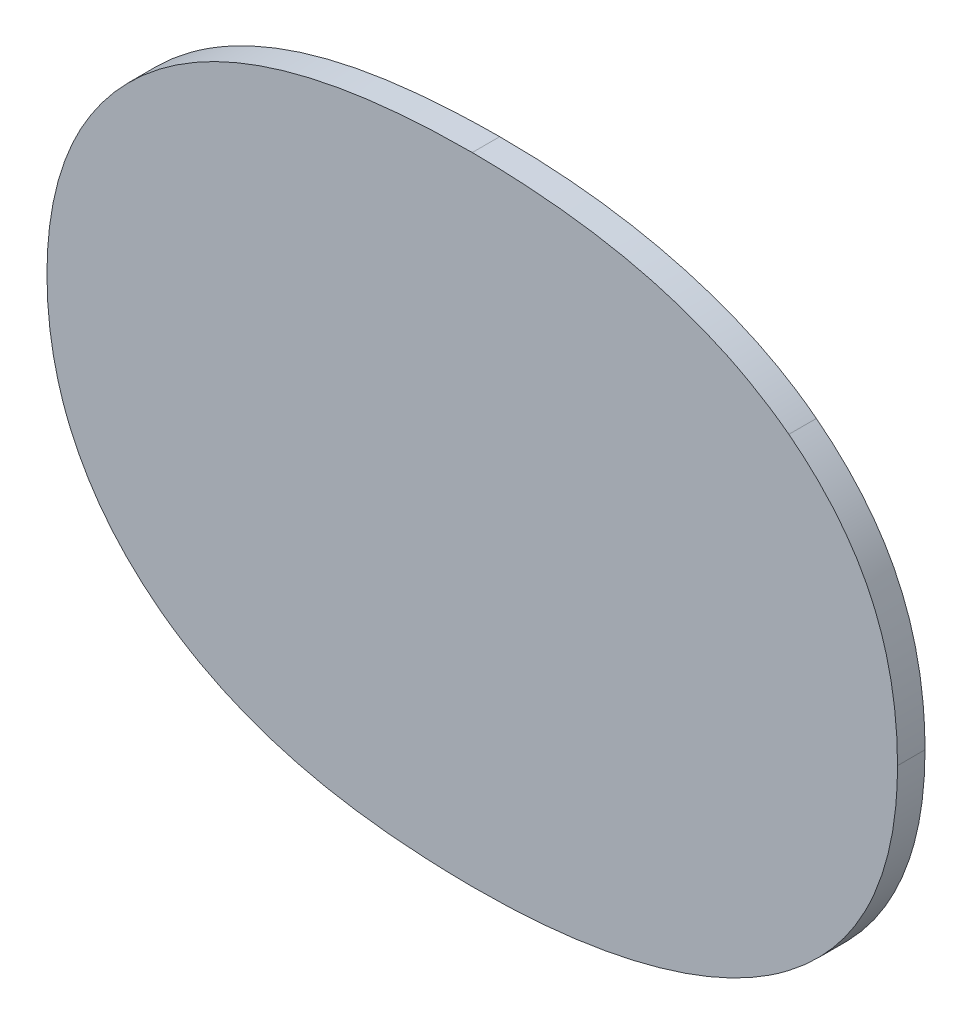
ISO-10303-21;
HEADER;
FILE_DESCRIPTION(('STEP AP214'),'2;1');
FILE_NAME('part.step','',(''),(''),'','','');
FILE_SCHEMA(('AUTOMOTIVE_DESIGN { 1 0 10303 214 1 1 1 1 }'));
ENDSEC;
DATA;
#1=APPLICATION_CONTEXT('core data for automotive mechanical design processes');
#2=APPLICATION_PROTOCOL_DEFINITION('international standard','automotive_design',2000,#1);
#3=PRODUCT_CONTEXT('',#1,'mechanical');
#4=PRODUCT('Part','Part','',(#3));
#5=PRODUCT_RELATED_PRODUCT_CATEGORY('part','',(#4));
#6=PRODUCT_DEFINITION_FORMATION('','',#4);
#7=PRODUCT_DEFINITION_CONTEXT('part definition',#1,'design');
#8=PRODUCT_DEFINITION('design','',#6,#7);
#9=PRODUCT_DEFINITION_SHAPE('','',#8);
#10=(LENGTH_UNIT() NAMED_UNIT(*) SI_UNIT(.MILLI.,.METRE.));
#11=(NAMED_UNIT(*) PLANE_ANGLE_UNIT() SI_UNIT($,.RADIAN.));
#12=(NAMED_UNIT(*) SI_UNIT($,.STERADIAN.) SOLID_ANGLE_UNIT());
#13=UNCERTAINTY_MEASURE_WITH_UNIT(LENGTH_MEASURE(1.E-05),#10,'distance_accuracy_value','');
#14=(GEOMETRIC_REPRESENTATION_CONTEXT(3) GLOBAL_UNCERTAINTY_ASSIGNED_CONTEXT((#13)) GLOBAL_UNIT_ASSIGNED_CONTEXT((#10,
#11,#12)) REPRESENTATION_CONTEXT('',''));
#15=CARTESIAN_POINT('',(0.,0.,0.));
#16=DIRECTION('',(0.,0.,1.));
#17=DIRECTION('',(1.,0.,0.));
#18=AXIS2_PLACEMENT_3D('',#15,#16,#17);
#19=CARTESIAN_POINT('',(0.330018694056405,-1.00582244370571,0.001));
#20=DIRECTION('',(0.,0.,1.));
#21=DIRECTION('',(1.,0.,0.));
#22=AXIS2_PLACEMENT_3D('',#19,#20,#21);
#23=PLANE('',#22);
#24=CARTESIAN_POINT('',(0.287648888188048,-0.960760147544726,0.001));
#25=CARTESIAN_POINT('',(0.287649005215071,-0.9619487170674,0.00100000000384696));
#26=CARTESIAN_POINT('',(0.287725325949338,-0.963141326834819,0.00100000000192568));
#27=CARTESIAN_POINT('',(0.288059608572213,-0.965502375043992,0.000999999998070462));
#28=CARTESIAN_POINT('',(0.288317934337942,-0.966670760228966,0.000999999996136518));
#29=CARTESIAN_POINT('',(0.289294358091378,-0.969723502299595,0.001000000006495));
#30=CARTESIAN_POINT('',(0.290206014097847,-0.97155150157758,0.00100000002941247));
#31=CARTESIAN_POINT('',(0.292573572998405,-0.974882945222282,0.000999999969746105));
#32=CARTESIAN_POINT('',(0.294044620859483,-0.976375327358517,0.000999999884055492));
#33=CARTESIAN_POINT('',(0.297542324630192,-0.979076673889466,0.00100000013128626));
#34=CARTESIAN_POINT('',(0.299616742643852,-0.980222006913312,0.00100000052109873));
#35=CARTESIAN_POINT('',(0.304359696025352,-0.982143609858495,0.000999999566090894));
#36=CARTESIAN_POINT('',(0.307067297804827,-0.982813103951955,0.00099999788868256));
#37=CARTESIAN_POINT('',(0.312728921384447,-0.983673004255862,0.000999996263713567));
#38=CARTESIAN_POINT('',(0.315688122811678,-0.98383333539022,0.00099999642225062));
#39=CARTESIAN_POINT('',(0.318585842328517,-0.983854799934389,0.001));
#40=B_SPLINE_CURVE_WITH_KNOTS('',3,(#24,#25,#26,#27,#28,#29,#30,#31,#32,#33,#34,#35,#36,#37,#38,
#39),.UNSPECIFIED.,.F.,.F.,(4,2,2,2,2,2,2,4),(0.,0.00356883173266012,0.00714481884339402,
0.0131645350331199,0.0193603981146465,0.0263760981617803,0.0346835017565834,0.043473268911056),.UNSPECIFIED.);
#41=CARTESIAN_POINT('',(0.287648888188048,-0.960760147544726,0.001));
#42=VERTEX_POINT('',#41);
#43=CARTESIAN_POINT('',(0.318585842325004,-0.983854799934389,0.001));
#44=VERTEX_POINT('',#43);
#45=EDGE_CURVE('E11',#42,#44,#40,.T.);
#46=ORIENTED_EDGE('',*,*,#45,.T.);
#47=CARTESIAN_POINT('',(0.318585842325004,-0.983854799934389,0.001));
#48=CARTESIAN_POINT('',(0.320751226493989,-0.98385536672234,0.0010000000000014));
#49=CARTESIAN_POINT('',(0.322919493580261,-0.983755728216249,0.00100000000000089));
#50=CARTESIAN_POINT('',(0.327265832064789,-0.983275678935964,0.000999999999999091));
#51=CARTESIAN_POINT('',(0.329443267734452,-0.982889822001773,0.000999999999997787));
#52=CARTESIAN_POINT('',(0.334293330134332,-0.981599471822699,0.0009999999999976));
#53=CARTESIAN_POINT('',(0.336943741838143,-0.980584384864894,0.000999999999999454));
#54=CARTESIAN_POINT('',(0.340132097248493,-0.978689749540543,0.00100000000000018));
#55=CARTESIAN_POINT('',(0.340892098102522,-0.978178056647698,0.00100000000000022));
#56=CARTESIAN_POINT('',(0.341618744245066,-0.977618008829139,0.001));
#57=B_SPLINE_CURVE_WITH_KNOTS('',3,(#47,#48,#49,#50,#51,#52,#53,#54,#55,#56),.UNSPECIFIED.,.F.,
.F.,(4,2,2,2,4),(0.,0.00649453971746793,0.0131159337882493,0.0214973120388725,
0.024242719455153),.UNSPECIFIED.);
#58=CARTESIAN_POINT('',(0.341618744307208,-0.977618008781029,0.001));
#59=VERTEX_POINT('',#58);
#60=EDGE_CURVE('E183',#44,#59,#57,.T.);
#61=ORIENTED_EDGE('',*,*,#60,.T.);
#62=CARTESIAN_POINT('',(0.341618744307208,-0.977618008781029,0.001));
#63=CARTESIAN_POINT('',(0.342450233410628,-0.976982911885251,0.001));
#64=CARTESIAN_POINT('',(0.343237230051263,-0.976287332231865,0.001));
#65=CARTESIAN_POINT('',(0.344688579569217,-0.974787262649049,0.001));
#66=CARTESIAN_POINT('',(0.345353672508173,-0.973983485044357,0.001));
#67=CARTESIAN_POINT('',(0.347058283126174,-0.971520080367524,0.001));
#68=CARTESIAN_POINT('',(0.347914766720795,-0.969727985699742,0.001));
#69=CARTESIAN_POINT('',(0.348858519733914,-0.966712602976792,0.001));
#70=CARTESIAN_POINT('',(0.349114926221105,-0.965535530308516,0.001));
#71=CARTESIAN_POINT('',(0.349447113680645,-0.963158248095715,0.001));
#72=CARTESIAN_POINT('',(0.34952331989203,-0.96195809977256,0.001));
#73=CARTESIAN_POINT('',(0.34952279646196,-0.960760147544727,0.001));
#74=B_SPLINE_CURVE_WITH_KNOTS('',3,(#62,#63,#64,#65,#66,#67,#68,#69,#70,#71,#72,#73),
.UNSPECIFIED.,.F.,.F.,(4,2,2,2,2,4),(0.,0.00313767957347167,0.00625562956611713,
0.0121074796833526,0.0157094539187396,0.0193029196470819),.UNSPECIFIED.);
#75=CARTESIAN_POINT('',(0.34952279646196,-0.960760147544726,0.001));
#76=VERTEX_POINT('',#75);
#77=EDGE_CURVE('E96',#59,#76,#74,.T.);
#78=ORIENTED_EDGE('',*,*,#77,.T.);
#79=CARTESIAN_POINT('',(0.34952279646196,-0.960760147544726,0.001));
#80=CARTESIAN_POINT('',(0.349523548948335,-0.959549372536118,0.001));
#81=CARTESIAN_POINT('',(0.349453291317558,-0.958331759192635,0.001));
#82=CARTESIAN_POINT('',(0.349135438528417,-0.955918825348777,0.001));
#83=CARTESIAN_POINT('',(0.348887547457034,-0.954723545466599,0.001));
#84=CARTESIAN_POINT('',(0.348252152324634,-0.952636268300923,0.001));
#85=CARTESIAN_POINT('',(0.347904123179968,-0.951732671050047,0.001));
#86=CARTESIAN_POINT('',(0.347064804337636,-0.949996662602551,0.001));
#87=CARTESIAN_POINT('',(0.346573842940221,-0.9491640938652,0.001));
#88=CARTESIAN_POINT('',(0.34541506732656,-0.947513247778961,0.001));
#89=CARTESIAN_POINT('',(0.344734925052515,-0.946703755756864,0.001));
#90=CARTESIAN_POINT('',(0.34325636380557,-0.945190001170773,0.001));
#91=CARTESIAN_POINT('',(0.342457213937709,-0.944486447113169,0.001));
#92=CARTESIAN_POINT('',(0.341618744280153,-0.943840535880056,0.001));
#93=B_SPLINE_CURVE_WITH_KNOTS('',3,(#79,#80,#81,#82,#83,#84,#85,#86,#87,#88,#89,#90,#91,#92),
.UNSPECIFIED.,.F.,.F.,(4,2,2,2,2,2,4),(0.,0.00364101332098709,0.00728810621504718,
0.0101809564853243,0.013067213913039,0.0162262183565188,0.0194054918305431),.UNSPECIFIED.);
#94=CARTESIAN_POINT('',(0.341618744307208,-0.943840535900962,0.001));
#95=VERTEX_POINT('',#94);
#96=EDGE_CURVE('E212',#76,#95,#93,.T.);
#97=ORIENTED_EDGE('',*,*,#96,.T.);
#98=CARTESIAN_POINT('',(0.341618744307208,-0.943840535900962,0.001));
#99=CARTESIAN_POINT('',(0.339890791342245,-0.942530952051037,0.000999999999994316));
#100=CARTESIAN_POINT('',(0.338021776929604,-0.941481362779544,0.000999999999991961));
#101=CARTESIAN_POINT('',(0.333325239288183,-0.939478931022741,0.000999999999990828));
#102=CARTESIAN_POINT('',(0.33041017863811,-0.9387270990069,0.000999999999993823));
#103=CARTESIAN_POINT('',(0.324498548170291,-0.93780068161105,0.000999999999999251));
#104=CARTESIAN_POINT('',(0.321502574982262,-0.937622646983642,0.00100000000000169));
#105=CARTESIAN_POINT('',(0.318585842325004,-0.937603744747602,0.001));
#106=B_SPLINE_CURVE_WITH_KNOTS('',3,(#98,#99,#100,#101,#102,#103,#104,#105),.UNSPECIFIED.,.F.,
.F.,(4,2,2,4),(0.,0.00641188604778611,0.0153497650356351,0.0242338148786471),.UNSPECIFIED.);
#107=CARTESIAN_POINT('',(0.318585842325004,-0.937603744747602,0.001));
#108=VERTEX_POINT('',#107);
#109=EDGE_CURVE('E203',#95,#108,#106,.T.);
#110=ORIENTED_EDGE('',*,*,#109,.T.);
#111=CARTESIAN_POINT('',(0.318585842325004,-0.937603744747602,0.001));
#112=CARTESIAN_POINT('',(0.314373528478816,-0.937609447161261,0.00100000095311508));
#113=CARTESIAN_POINT('',(0.309889509227351,-0.937973346747132,0.00100000063493109));
#114=CARTESIAN_POINT('',(0.302835424019798,-0.939839601648971,0.000999999980091849));
#115=CARTESIAN_POINT('',(0.30012847286835,-0.940918384140875,0.000999999685559421));
#116=CARTESIAN_POINT('',(0.295797873262194,-0.943624908472912,0.000999999725196644));
#117=CARTESIAN_POINT('',(0.294068392174046,-0.945068497675714,0.00099999992995706));
#118=CARTESIAN_POINT('',(0.291299760936764,-0.948255742262626,0.00100000006272447));
#119=CARTESIAN_POINT('',(0.290207491131468,-0.9499525200136,0.00100000001732131));
#120=CARTESIAN_POINT('',(0.288586966958287,-0.953650259188375,0.000999999982196164));
#121=CARTESIAN_POINT('',(0.288075175269353,-0.955658345038229,0.000999999994051517));
#122=CARTESIAN_POINT('',(0.287703409276111,-0.958712928005123,0.00100000000298625));
#123=CARTESIAN_POINT('',(0.287645734606858,-0.959740124288295,0.00100000000448434));
#124=CARTESIAN_POINT('',(0.287648888188048,-0.960760147544727,0.001));
#125=B_SPLINE_CURVE_WITH_KNOTS('',3,(#111,#112,#113,#114,#115,#116,#117,#118,#119,#120,#121,
#122,#123,#124),.UNSPECIFIED.,.F.,.F.,(4,2,2,2,2,2,4),(0.,0.0130211709281051,0.021667521322224,
0.0283183969219233,0.0342769513444242,0.0404005707347108,0.0434736921245707),.UNSPECIFIED.);
#126=EDGE_CURVE('E230',#108,#42,#125,.T.);
#127=ORIENTED_EDGE('',*,*,#126,.T.);
#128=EDGE_LOOP('',(#46,#61,#78,#97,#110,#127));
#129=FACE_BOUND('',#128,.T.);
#130=ADVANCED_FACE('F17',(#129),#23,.T.);
#131=CARTESIAN_POINT('',(0.330018694056405,-1.00582244370571,-0.001));
#132=DIRECTION('',(0.,0.,1.));
#133=DIRECTION('',(1.,0.,0.));
#134=AXIS2_PLACEMENT_3D('',#131,#132,#133);
#135=PLANE('',#134);
#136=CARTESIAN_POINT('',(0.318585842325004,-0.983854799934389,-0.001));
#137=CARTESIAN_POINT('',(0.314366421551902,-0.983847517636832,-0.000999999044163728));
#138=CARTESIAN_POINT('',(0.309873838599395,-0.983485599906049,-0.000999999363432696));
#139=CARTESIAN_POINT('',(0.302810493669247,-0.981621521650494,-0.00100000001843587));
#140=CARTESIAN_POINT('',(0.300102392599748,-0.980544846197732,-0.00100000031234204));
#141=CARTESIAN_POINT('',(0.295776614962043,-0.977846293288236,-0.00100000027167754));
#142=CARTESIAN_POINT('',(0.294052063819949,-0.976410947406675,-0.00100000006807725));
#143=CARTESIAN_POINT('',(0.291292391378691,-0.973239583538093,-0.000999999939035142));
#144=CARTESIAN_POINT('',(0.290204081616233,-0.971550615552746,-0.000999999986766609));
#145=CARTESIAN_POINT('',(0.288588403124606,-0.967869125205788,-0.00100000001358846));
#146=CARTESIAN_POINT('',(0.288077677095912,-0.965869399579567,-0.000999999990709932));
#147=CARTESIAN_POINT('',(0.287703981458283,-0.962817869402081,-0.000999999983649557));
#148=CARTESIAN_POINT('',(0.287645717611925,-0.961785353551932,-0.000999999985941685));
#149=CARTESIAN_POINT('',(0.287648888188048,-0.960760147515724,-0.001));
#150=B_SPLINE_CURVE_WITH_KNOTS('',3,(#136,#137,#138,#139,#140,#141,#142,#143,#144,#145,#146,
#147,#148,#149),.UNSPECIFIED.,.F.,.F.,(4,2,2,2,2,2,4),(0.,0.0130449706261398,0.0216926494513499,
0.0283167725430079,0.0342491663718016,0.0403484599218989,0.0434373355161913),.UNSPECIFIED.);
#151=CARTESIAN_POINT('',(0.318585842325004,-0.983854799934389,-0.001));
#152=VERTEX_POINT('',#151);
#153=CARTESIAN_POINT('',(0.287648888188048,-0.960760147544726,-0.001));
#154=VERTEX_POINT('',#153);
#155=EDGE_CURVE('E30',#152,#154,#150,.T.);
#156=ORIENTED_EDGE('',*,*,#155,.T.);
#157=CARTESIAN_POINT('',(0.287648888188048,-0.960760147544727,-0.001));
#158=CARTESIAN_POINT('',(0.287648986117702,-0.959569034293751,-0.001000000000001));
#159=CARTESIAN_POINT('',(0.287725658313812,-0.958373872412441,-0.00100000000000065));
#160=CARTESIAN_POINT('',(0.288061134194404,-0.956008050997586,-0.000999999999999352));
#161=CARTESIAN_POINT('',(0.288320267894328,-0.954837439825258,-0.000999999999998404));
#162=CARTESIAN_POINT('',(0.289300458322241,-0.951774911438817,-0.000999999999997878));
#163=CARTESIAN_POINT('',(0.29021654895802,-0.949939914480474,-0.000999999999999688));
#164=CARTESIAN_POINT('',(0.29259581116323,-0.946591395387857,-0.00100000000000032));
#165=CARTESIAN_POINT('',(0.294075147938396,-0.945089678885757,-0.000999999999999052));
#166=CARTESIAN_POINT('',(0.297586503746203,-0.942378134944625,-0.00100000000000107));
#167=CARTESIAN_POINT('',(0.299665010242488,-0.941230201933588,-0.00100000000000496));
#168=CARTESIAN_POINT('',(0.30443677348397,-0.939297973039787,-0.000999999999996101));
#169=CARTESIAN_POINT('',(0.307171296269495,-0.938626439455594,-0.00099999999998));
#170=CARTESIAN_POINT('',(0.312817069157564,-0.93778115617338,-0.000999999999965077));
#171=CARTESIAN_POINT('',(0.315731174473234,-0.93762433182532,-0.000999999999966836));
#172=CARTESIAN_POINT('',(0.318585842330089,-0.937603744747602,-0.001));
#173=B_SPLINE_CURVE_WITH_KNOTS('',3,(#157,#158,#159,#160,#161,#162,#163,#164,#165,#166,#167,
#168,#169,#170,#171,#172),.UNSPECIFIED.,.F.,.F.,(4,2,2,2,2,2,2,4),(0.,0.00357647166268595,
0.00715942870891707,0.0132037371783002,0.0194364805216008,0.0264663559896395,0.0348514369269409,
0.0435096224691789),.UNSPECIFIED.);
#174=CARTESIAN_POINT('',(0.318585842325004,-0.937603744747602,-0.001));
#175=VERTEX_POINT('',#174);
#176=EDGE_CURVE('E171',#154,#175,#173,.T.);
#177=ORIENTED_EDGE('',*,*,#176,.T.);
#178=CARTESIAN_POINT('',(0.318585842325004,-0.937603744747602,-0.001));
#179=CARTESIAN_POINT('',(0.320795947519682,-0.937606803868519,-0.000999999999999173));
#180=CARTESIAN_POINT('',(0.323009365791585,-0.937710720091127,-0.000999999999999471));
#181=CARTESIAN_POINT('',(0.327449629162377,-0.93821040835878,-0.00100000000000054));
#182=CARTESIAN_POINT('',(0.329675723936123,-0.93861246269271,-0.00100000000000132));
#183=CARTESIAN_POINT('',(0.334583309042491,-0.93995198689285,-0.00100000000000147));
#184=CARTESIAN_POINT('',(0.337243042505758,-0.940996344099389,-0.00100000000000045));
#185=CARTESIAN_POINT('',(0.340320240978279,-0.942890082006594,-0.000999999999999999));
#186=CARTESIAN_POINT('',(0.340982818421021,-0.943346312000129,-0.000999999999999951));
#187=CARTESIAN_POINT('',(0.341618744307208,-0.943840535900962,-0.001));
#188=B_SPLINE_CURVE_WITH_KNOTS('',3,(#178,#179,#180,#181,#182,#183,#184,#185,#186,#187),
.UNSPECIFIED.,.F.,.F.,(4,2,2,2,4),(0.,0.00662929886616455,0.0134024062376557,0.0218318012784063,
0.0242429021354738),.UNSPECIFIED.);
#189=CARTESIAN_POINT('',(0.341618744307208,-0.943840535900962,-0.001));
#190=VERTEX_POINT('',#189);
#191=EDGE_CURVE('E177',#175,#190,#188,.T.);
#192=ORIENTED_EDGE('',*,*,#191,.T.);
#193=CARTESIAN_POINT('',(0.341618744307208,-0.943840535900962,-0.001));
#194=CARTESIAN_POINT('',(0.34246935226857,-0.944495612873888,-0.001));
#195=CARTESIAN_POINT('',(0.343279509458944,-0.94521028812663,-0.001));
#196=CARTESIAN_POINT('',(0.344775886313104,-0.946749172122451,-0.001));
#197=CARTESIAN_POINT('',(0.345462901945643,-0.94757261284938,-0.001));
#198=CARTESIAN_POINT('',(0.346607782141308,-0.949220868245572,-0.001));
#199=CARTESIAN_POINT('',(0.347083400325571,-0.950033184030352,-0.001));
#200=CARTESIAN_POINT('',(0.347899392675749,-0.951724890862383,-0.001));
#201=CARTESIAN_POINT('',(0.348239464379677,-0.952604426756109,-0.001));
#202=CARTESIAN_POINT('',(0.348876473376109,-0.954675090827354,-0.001));
#203=CARTESIAN_POINT('',(0.349128720784996,-0.955879526644115,-0.001));
#204=CARTESIAN_POINT('',(0.349452172395762,-0.958311765953953,-0.001));
#205=CARTESIAN_POINT('',(0.349523628235547,-0.959539534568462,-0.001));
#206=CARTESIAN_POINT('',(0.34952279646196,-0.960760147893445,-0.001));
#207=B_SPLINE_CURVE_WITH_KNOTS('',3,(#193,#194,#195,#196,#197,#198,#199,#200,#201,#202,#203,
#204,#205,#206),.UNSPECIFIED.,.F.,.F.,(4,2,2,2,2,2,4),(0.,0.0032252850886018,
0.00642890499209278,0.0092404946056607,0.0120583234146673,0.0157344504361534,
0.0194054579541488),.UNSPECIFIED.);
#208=CARTESIAN_POINT('',(0.34952279646196,-0.960760147544726,-0.001));
#209=VERTEX_POINT('',#208);
#210=EDGE_CURVE('E83',#190,#209,#207,.T.);
#211=ORIENTED_EDGE('',*,*,#210,.T.);
#212=CARTESIAN_POINT('',(0.34952279646196,-0.960760147544726,-0.001));
#213=CARTESIAN_POINT('',(0.349523218441542,-0.961989186536463,-0.001));
#214=CARTESIAN_POINT('',(0.349443012571218,-0.963220750385404,-0.001));
#215=CARTESIAN_POINT('',(0.349092686134763,-0.965658734389133,-0.001));
#216=CARTESIAN_POINT('',(0.348822107086176,-0.9668650865889,-0.001));
#217=CARTESIAN_POINT('',(0.34781818628156,-0.969970742162274,-0.001));
#218=CARTESIAN_POINT('',(0.346899289069444,-0.971817818432658,-0.001));
#219=CARTESIAN_POINT('',(0.345139145483709,-0.974248333086873,-0.001));
#220=CARTESIAN_POINT('',(0.34450530698169,-0.974989924749701,-0.001));
#221=CARTESIAN_POINT('',(0.343133703534309,-0.976377922759676,-0.001));
#222=CARTESIAN_POINT('',(0.342395423474838,-0.977023822711675,-0.001));
#223=CARTESIAN_POINT('',(0.341618744282845,-0.977618008799682,-0.001));
#224=B_SPLINE_CURVE_WITH_KNOTS('',3,(#212,#213,#214,#215,#216,#217,#218,#219,#220,#221,#222,
#223),.UNSPECIFIED.,.F.,.F.,(4,2,2,2,2,4),(0.,0.00368693426224474,0.00738277842821367,
0.0134508657488747,0.0163682753424632,0.0193006108876787),.UNSPECIFIED.);
#225=CARTESIAN_POINT('',(0.341618744307208,-0.977618008781029,-0.001));
#226=VERTEX_POINT('',#225);
#227=EDGE_CURVE('E86',#209,#226,#224,.T.);
#228=ORIENTED_EDGE('',*,*,#227,.T.);
#229=CARTESIAN_POINT('',(0.341618743293386,-0.977618009565924,-0.001));
#230=CARTESIAN_POINT('',(0.339919763791678,-0.978894282298518,-0.00100000000001381));
#231=CARTESIAN_POINT('',(0.338086676543403,-0.979926485569347,-0.00100000000001769));
#232=CARTESIAN_POINT('',(0.333521019190679,-0.981896100491738,-0.00100000000001503));
#233=CARTESIAN_POINT('',(0.330708942250461,-0.982652772692799,-0.00100000000000406));
#234=CARTESIAN_POINT('',(0.324770449564614,-0.983648052580836,-0.000999999999988423));
#235=CARTESIAN_POINT('',(0.321636103936314,-0.983844606679786,-0.00099999999998428));
#236=CARTESIAN_POINT('',(0.318585842325004,-0.983854799934389,-0.001));
#237=B_SPLINE_CURVE_WITH_KNOTS('',3,(#229,#230,#231,#232,#233,#234,#235,#236),.UNSPECIFIED.,.F.,
.F.,(4,2,2,4),(0.,0.00629255334664203,0.0149450966661804,0.0242320632035471),.UNSPECIFIED.);
#238=EDGE_CURVE('E74',#226,#152,#237,.T.);
#239=ORIENTED_EDGE('',*,*,#238,.T.);
#240=EDGE_LOOP('',(#156,#177,#192,#211,#228,#239));
#241=FACE_BOUND('',#240,.T.);
#242=ADVANCED_FACE('F87',(#241),#135,.F.);
#243=CARTESIAN_POINT('',(0.341618744307208,-0.943840535900962,-0.0015));
#244=CARTESIAN_POINT('',(0.341618744307208,-0.943840535900962,0.0015));
#245=CARTESIAN_POINT('',(0.337728468637292,-0.94081476593547,-0.0015));
#246=CARTESIAN_POINT('',(0.337728468637292,-0.94081476593547,0.0015));
#247=CARTESIAN_POINT('',(0.325995891220084,-0.937603744747602,-0.0015));
#248=CARTESIAN_POINT('',(0.325995891220084,-0.937603744747602,0.0015));
#249=CARTESIAN_POINT('',(0.318585842325004,-0.937603744747602,-0.0015));
#250=CARTESIAN_POINT('',(0.318585842325004,-0.937603744747602,0.0015));
#251=B_SPLINE_SURFACE_WITH_KNOTS('',2,1,((#243,#244),(#245,#246),(#247,#248),(#249,#250)),
.UNSPECIFIED.,.F.,.F.,.F.,(3,1,3),(2,2),(0.,0.5,1.),(0.,1.),.UNSPECIFIED.);
#252=DIRECTION('',(0.,0.,1.));
#253=VECTOR('',#252,1.);
#254=CARTESIAN_POINT('',(0.318585842325004,-0.937603744747602,-0.001));
#255=LINE('',#254,#253);
#256=EDGE_CURVE('E218',#175,#108,#255,.T.);
#257=DIRECTION('',(0.,0.,1.));
#258=VECTOR('',#257,1.);
#259=CARTESIAN_POINT('',(0.341618744307208,-0.943840535900962,-0.001));
#260=LINE('',#259,#258);
#261=EDGE_CURVE('E92',#190,#95,#260,.T.);
#262=ORIENTED_EDGE('',*,*,#191,.F.);
#263=ORIENTED_EDGE('',*,*,#256,.T.);
#264=ORIENTED_EDGE('',*,*,#109,.F.);
#265=ORIENTED_EDGE('',*,*,#261,.F.);
#266=EDGE_LOOP('',(#262,#263,#264,#265));
#267=FACE_BOUND('',#266,.T.);
#268=ADVANCED_FACE('F147',(#267),#251,.T.);
#269=CARTESIAN_POINT('',(0.318585842325004,-0.937603744747602,-0.0015));
#270=CARTESIAN_POINT('',(0.318585842325004,-0.937603744747602,0.0015));
#271=CARTESIAN_POINT('',(0.303580493312468,-0.937603744747602,-0.0015));
#272=CARTESIAN_POINT('',(0.303580493312468,-0.937603744747602,0.0015));
#273=CARTESIAN_POINT('',(0.287648888188048,-0.950200827869237,-0.0015));
#274=CARTESIAN_POINT('',(0.287648888188048,-0.950200827869237,0.0015));
#275=CARTESIAN_POINT('',(0.287648888188048,-0.960760147544726,-0.0015));
#276=CARTESIAN_POINT('',(0.287648888188048,-0.960760147544726,0.0015));
#277=B_SPLINE_SURFACE_WITH_KNOTS('',2,1,((#269,#270),(#271,#272),(#273,#274),(#275,#276)),
.UNSPECIFIED.,.F.,.F.,.F.,(3,1,3),(2,2),(0.,0.5,1.),(0.,1.),.UNSPECIFIED.);
#278=DIRECTION('',(0.,0.,1.));
#279=VECTOR('',#278,1.);
#280=CARTESIAN_POINT('',(0.287648888188048,-0.960760147544727,-0.001));
#281=LINE('',#280,#279);
#282=EDGE_CURVE('E210',#154,#42,#281,.T.);
#283=ORIENTED_EDGE('',*,*,#176,.F.);
#284=ORIENTED_EDGE('',*,*,#282,.T.);
#285=ORIENTED_EDGE('',*,*,#126,.F.);
#286=ORIENTED_EDGE('',*,*,#256,.F.);
#287=EDGE_LOOP('',(#283,#284,#285,#286));
#288=FACE_BOUND('',#287,.T.);
#289=ADVANCED_FACE('F122',(#288),#277,.T.);
#290=CARTESIAN_POINT('',(0.287648888188048,-0.960760147544726,-0.0015));
#291=CARTESIAN_POINT('',(0.287648888188048,-0.960760147544726,0.0015));
#292=CARTESIAN_POINT('',(0.287648888188048,-0.971319467220213,-0.0015));
#293=CARTESIAN_POINT('',(0.287648888188048,-0.971319467220213,0.0015));
#294=CARTESIAN_POINT('',(0.303580493312468,-0.983854799934389,-0.0015));
#295=CARTESIAN_POINT('',(0.303580493312468,-0.983854799934389,0.0015));
#296=CARTESIAN_POINT('',(0.318585842325004,-0.983854799934389,-0.0015));
#297=CARTESIAN_POINT('',(0.318585842325004,-0.983854799934389,0.0015));
#298=B_SPLINE_SURFACE_WITH_KNOTS('',2,1,((#290,#291),(#292,#293),(#294,#295),(#296,#297)),
.UNSPECIFIED.,.F.,.F.,.F.,(3,1,3),(2,2),(0.,0.5,1.),(0.,1.),.UNSPECIFIED.);
#299=DIRECTION('',(0.,0.,-1.));
#300=VECTOR('',#299,1.);
#301=CARTESIAN_POINT('',(0.318585842325004,-0.98385479993439,0.001));
#302=LINE('',#301,#300);
#303=EDGE_CURVE('E82',#44,#152,#302,.T.);
#304=ORIENTED_EDGE('',*,*,#155,.F.);
#305=ORIENTED_EDGE('',*,*,#303,.F.);
#306=ORIENTED_EDGE('',*,*,#45,.F.);
#307=ORIENTED_EDGE('',*,*,#282,.F.);
#308=EDGE_LOOP('',(#304,#305,#306,#307));
#309=FACE_BOUND('',#308,.T.);
#310=ADVANCED_FACE('F148',(#309),#298,.T.);
#311=CARTESIAN_POINT('',(0.318585842325004,-0.983854799934389,-0.0015));
#312=CARTESIAN_POINT('',(0.318585842325004,-0.983854799934389,0.0015));
#313=CARTESIAN_POINT('',(0.326119392035002,-0.983854799934389,-0.0015));
#314=CARTESIAN_POINT('',(0.326119392035002,-0.983854799934389,0.0015));
#315=CARTESIAN_POINT('',(0.337790219044751,-0.980582028339062,-0.0015));
#316=CARTESIAN_POINT('',(0.337790219044751,-0.980582028339062,0.0015));
#317=CARTESIAN_POINT('',(0.341618744307208,-0.977618008781029,-0.0015));
#318=CARTESIAN_POINT('',(0.341618744307208,-0.977618008781029,0.0015));
#319=B_SPLINE_SURFACE_WITH_KNOTS('',2,1,((#311,#312),(#313,#314),(#315,#316),(#317,#318)),
.UNSPECIFIED.,.F.,.F.,.F.,(3,1,3),(2,2),(0.,0.5,1.),(0.,1.),.UNSPECIFIED.);
#320=CARTESIAN_POINT('',(0.341618742279564,-0.977618010350817,-0.001));
#321=CARTESIAN_POINT('',(0.341618742385171,-0.977618010269057,-0.000958333333333336));
#322=CARTESIAN_POINT('',(0.341618742490777,-0.977618010187298,-0.000916666666666671));
#323=CARTESIAN_POINT('',(0.34161874270001,-0.977618010025311,-0.000833333333333339));
#324=CARTESIAN_POINT('',(0.341618742803636,-0.977618009945084,-0.000791666666666674));
#325=CARTESIAN_POINT('',(0.341618743006929,-0.977618009787697,-0.000708333333333342));
#326=CARTESIAN_POINT('',(0.341618743106595,-0.977618009710536,-0.000666666666666677));
#327=CARTESIAN_POINT('',(0.341618743299987,-0.977618009560813,-0.000583333333333345));
#328=CARTESIAN_POINT('',(0.341618743393712,-0.977618009488251,-0.000541666666666679));
#329=CARTESIAN_POINT('',(0.341618743573243,-0.97761800934926,-0.000458333333333347));
#330=CARTESIAN_POINT('',(0.341618743659048,-0.97761800928283,-0.000416666666666681));
#331=CARTESIAN_POINT('',(0.341618743820758,-0.977618009157635,-0.000333333333333349));
#332=CARTESIAN_POINT('',(0.341618743896663,-0.97761800909887,-0.000291666666666682));
#333=CARTESIAN_POINT('',(0.341618744036592,-0.977618008990539,-0.000208333333333349));
#334=CARTESIAN_POINT('',(0.341618744100615,-0.977618008940972,-0.000166666666666682));
#335=CARTESIAN_POINT('',(0.341618744214802,-0.977618008852569,-8.33333333333478E-05));
#336=CARTESIAN_POINT('',(0.341618744264965,-0.977618008813733,-4.16666666666803E-05));
#337=CARTESIAN_POINT('',(0.341618744349451,-0.977618008748325,4.16666666666556E-05));
#338=CARTESIAN_POINT('',(0.341618744383773,-0.977618008721753,8.33333333333241E-05));
#339=CARTESIAN_POINT('',(0.341618744438556,-0.97761800867934,0.000166666666666661));
#340=CARTESIAN_POINT('',(0.341618744459017,-0.977618008663499,0.000208333333333329));
#341=CARTESIAN_POINT('',(0.341618744488059,-0.977618008641015,0.000291666666666664));
#342=CARTESIAN_POINT('',(0.341618744496639,-0.977618008634372,0.000333333333333332));
#343=CARTESIAN_POINT('',(0.3416187445039,-0.977618008628751,0.000416666666666666));
#344=CARTESIAN_POINT('',(0.34161874450258,-0.977618008629773,0.000458333333333334));
#345=CARTESIAN_POINT('',(0.341618744492019,-0.977618008637949,0.000541666666666668));
#346=CARTESIAN_POINT('',(0.341618744482779,-0.977618008645104,0.000583333333333335));
#347=CARTESIAN_POINT('',(0.341618744458357,-0.97761800866401,0.000666666666666668));
#348=CARTESIAN_POINT('',(0.341618744443176,-0.977618008675763,0.000708333333333335));
#349=CARTESIAN_POINT('',(0.341618744408854,-0.977618008702335,0.000791666666666669));
#350=CARTESIAN_POINT('',(0.341618744389713,-0.977618008717154,0.000833333333333336));
#351=CARTESIAN_POINT('',(0.341618744349451,-0.977618008748325,0.000916666666666669));
#352=CARTESIAN_POINT('',(0.341618744328329,-0.977618008764677,0.000958333333333336));
#353=CARTESIAN_POINT('',(0.341618744307208,-0.977618008781029,0.001));
#354=B_SPLINE_CURVE_WITH_KNOTS('',3,(#320,#321,#322,#323,#324,#325,#326,#327,#328,#329,#330,
#331,#332,#333,#334,#335,#336,#337,#338,#339,#340,#341,#342,#343,#344,#345,#346,#347,#348,#349,
#350,#351,#352,#353),.UNSPECIFIED.,.F.,.F.,(4,2,2,2,2,2,2,2,2,2,2,2,2,2,2,2,4),(0.,
0.000125000000000639,0.000250000000001254,0.000375000000001823,0.000500000000002325,
0.000625000000002746,0.000750000000003074,0.000875000000003308,0.00100000000000345,
0.00112500000000352,0.00125000000000354,0.00137500000000355,0.00150000000000355,
0.00162500000000355,0.00175000000000357,0.00187500000000359,0.00200000000000361),.UNSPECIFIED.);
#355=EDGE_CURVE('E79',#226,#59,#354,.T.);
#356=ORIENTED_EDGE('',*,*,#238,.F.);
#357=ORIENTED_EDGE('',*,*,#355,.T.);
#358=ORIENTED_EDGE('',*,*,#60,.F.);
#359=ORIENTED_EDGE('',*,*,#303,.T.);
#360=EDGE_LOOP('',(#356,#357,#358,#359));
#361=FACE_BOUND('',#360,.T.);
#362=ADVANCED_FACE('F76',(#361),#319,.T.);
#363=CARTESIAN_POINT('',(0.341618744307208,-0.977618008781029,-0.0015));
#364=CARTESIAN_POINT('',(0.341618744307208,-0.977618008781029,0.0015));
#365=CARTESIAN_POINT('',(0.345570770384585,-0.974592238815541,-0.0015));
#366=CARTESIAN_POINT('',(0.345570770384585,-0.974592238815541,0.0015));
#367=CARTESIAN_POINT('',(0.34952279646196,-0.966070682586198,-0.0015));
#368=CARTESIAN_POINT('',(0.34952279646196,-0.966070682586198,0.0015));
#369=CARTESIAN_POINT('',(0.34952279646196,-0.960760147544726,-0.0015));
#370=CARTESIAN_POINT('',(0.34952279646196,-0.960760147544726,0.0015));
#371=B_SPLINE_SURFACE_WITH_KNOTS('',2,1,((#363,#364),(#365,#366),(#367,#368),(#369,#370)),
.UNSPECIFIED.,.F.,.F.,.F.,(3,1,3),(2,2),(0.,0.5,1.),(0.,1.),.UNSPECIFIED.);
#372=DIRECTION('',(0.,0.,1.));
#373=VECTOR('',#372,1.);
#374=CARTESIAN_POINT('',(0.34952279646196,-0.960760147544727,-0.001));
#375=LINE('',#374,#373);
#376=EDGE_CURVE('E97',#209,#76,#375,.T.);
#377=ORIENTED_EDGE('',*,*,#227,.F.);
#378=ORIENTED_EDGE('',*,*,#376,.T.);
#379=ORIENTED_EDGE('',*,*,#77,.F.);
#380=ORIENTED_EDGE('',*,*,#355,.F.);
#381=EDGE_LOOP('',(#377,#378,#379,#380));
#382=FACE_BOUND('',#381,.T.);
#383=ADVANCED_FACE('F95',(#382),#371,.T.);
#384=CARTESIAN_POINT('',(0.34952279646196,-0.960760147544726,-0.0015));
#385=CARTESIAN_POINT('',(0.34952279646196,-0.960760147544726,0.0015));
#386=CARTESIAN_POINT('',(0.34952279646196,-0.955264361280875,-0.0015));
#387=CARTESIAN_POINT('',(0.34952279646196,-0.955264361280875,0.0015));
#388=CARTESIAN_POINT('',(0.345694271199503,-0.946989806681369,-0.0015));
#389=CARTESIAN_POINT('',(0.345694271199503,-0.946989806681369,0.0015));
#390=CARTESIAN_POINT('',(0.341618744307208,-0.943840535900962,-0.0015));
#391=CARTESIAN_POINT('',(0.341618744307208,-0.943840535900962,0.0015));
#392=B_SPLINE_SURFACE_WITH_KNOTS('',2,1,((#384,#385),(#386,#387),(#388,#389),(#390,#391)),
.UNSPECIFIED.,.F.,.F.,.F.,(3,1,3),(2,2),(0.,0.5,1.),(0.,1.),.UNSPECIFIED.);
#393=ORIENTED_EDGE('',*,*,#210,.F.);
#394=ORIENTED_EDGE('',*,*,#261,.T.);
#395=ORIENTED_EDGE('',*,*,#96,.F.);
#396=ORIENTED_EDGE('',*,*,#376,.F.);
#397=EDGE_LOOP('',(#393,#394,#395,#396));
#398=FACE_BOUND('',#397,.T.);
#399=ADVANCED_FACE('F118',(#398),#392,.T.);
#400=CLOSED_SHELL('',(#130,#242,#268,#289,#310,#362,#383,#399));
#401=MANIFOLD_SOLID_BREP('B1',#400);
#402=ADVANCED_BREP_SHAPE_REPRESENTATION('',(#18,#401),#14);
#403=SHAPE_DEFINITION_REPRESENTATION(#9,#402);
ENDSEC;
END-ISO-10303-21;
